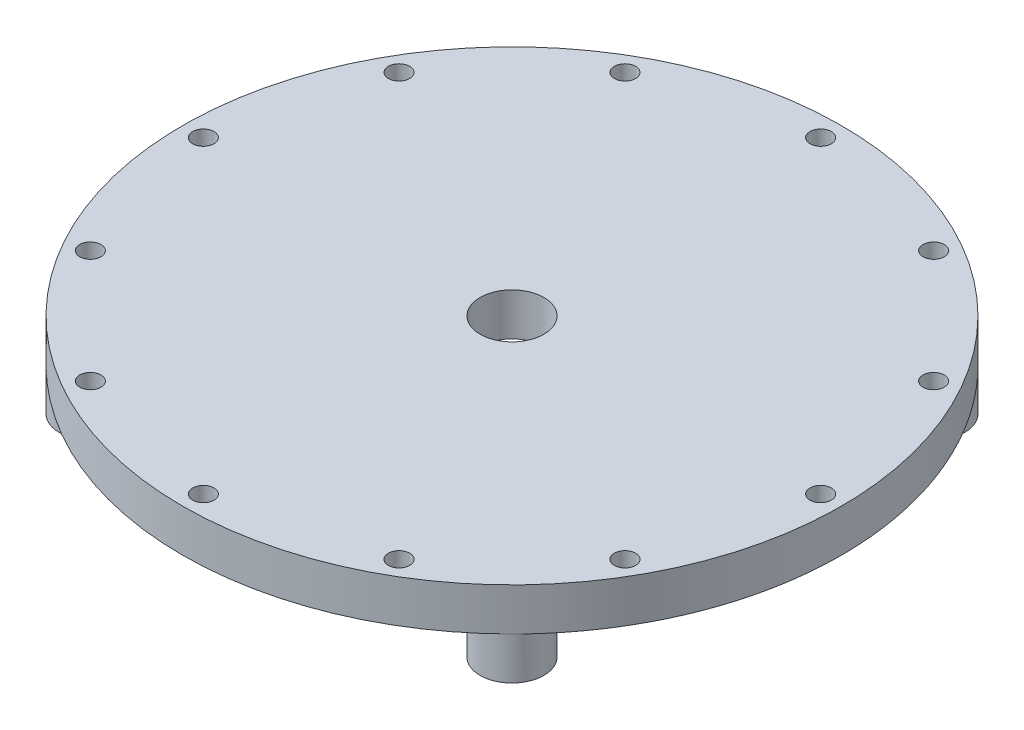
ISO-10303-21;
HEADER;
FILE_DESCRIPTION(('STEP AP214'),'2;1');
FILE_NAME('part.step','',(''),(''),'','','');
FILE_SCHEMA(('AUTOMOTIVE_DESIGN { 1 0 10303 214 1 1 1 1 }'));
ENDSEC;
DATA;
#1=APPLICATION_CONTEXT('core data for automotive mechanical design processes');
#2=APPLICATION_PROTOCOL_DEFINITION('international standard','automotive_design',2000,#1);
#3=PRODUCT_CONTEXT('',#1,'mechanical');
#4=PRODUCT('Part','Part','',(#3));
#5=PRODUCT_RELATED_PRODUCT_CATEGORY('part','',(#4));
#6=PRODUCT_DEFINITION_FORMATION('','',#4);
#7=PRODUCT_DEFINITION_CONTEXT('part definition',#1,'design');
#8=PRODUCT_DEFINITION('design','',#6,#7);
#9=PRODUCT_DEFINITION_SHAPE('','',#8);
#10=(LENGTH_UNIT() NAMED_UNIT(*) SI_UNIT(.MILLI.,.METRE.));
#11=(NAMED_UNIT(*) PLANE_ANGLE_UNIT() SI_UNIT($,.RADIAN.));
#12=(NAMED_UNIT(*) SI_UNIT($,.STERADIAN.) SOLID_ANGLE_UNIT());
#13=UNCERTAINTY_MEASURE_WITH_UNIT(LENGTH_MEASURE(1.E-05),#10,'distance_accuracy_value','');
#14=(GEOMETRIC_REPRESENTATION_CONTEXT(3) GLOBAL_UNCERTAINTY_ASSIGNED_CONTEXT((#13)) GLOBAL_UNIT_ASSIGNED_CONTEXT((#10,
#11,#12)) REPRESENTATION_CONTEXT('',''));
#15=CARTESIAN_POINT('',(0.,0.,0.));
#16=DIRECTION('',(0.,0.,1.));
#17=DIRECTION('',(1.,0.,0.));
#18=AXIS2_PLACEMENT_3D('',#15,#16,#17);
#19=CARTESIAN_POINT('',(0.,12.7,0.));
#20=DIRECTION('',(0.,-1.,0.));
#21=DIRECTION('',(0.,0.,-1.));
#22=AXIS2_PLACEMENT_3D('',#19,#20,#21);
#23=CYLINDRICAL_SURFACE('',#22,98.425);
#24=CARTESIAN_POINT('',(0.,12.7,0.));
#25=DIRECTION('',(0.,1.,0.));
#26=DIRECTION('',(0.,0.,1.));
#27=AXIS2_PLACEMENT_3D('',#24,#25,#26);
#28=CIRCLE('',#27,98.425);
#29=CARTESIAN_POINT('',(0.,12.7,98.425));
#30=VERTEX_POINT('',#29);
#31=EDGE_CURVE('E11',#30,#30,#28,.T.);
#32=ORIENTED_EDGE('',*,*,#31,.F.);
#33=EDGE_LOOP('',(#32));
#34=FACE_BOUND('',#33,.T.);
#35=CARTESIAN_POINT('',(0.,0.,0.));
#36=DIRECTION('',(0.,1.,0.));
#37=DIRECTION('',(0.,0.,1.));
#38=AXIS2_PLACEMENT_3D('',#35,#36,#37);
#39=CIRCLE('',#38,98.425);
#40=CARTESIAN_POINT('',(-69.5969849382863,0.,69.5969849382856));
#41=VERTEX_POINT('',#40);
#42=CARTESIAN_POINT('',(69.5969849382858,0.,69.5969849382861));
#43=VERTEX_POINT('',#42);
#44=EDGE_CURVE('E47',#41,#43,#39,.T.);
#45=ORIENTED_EDGE('',*,*,#44,.T.);
#46=CARTESIAN_POINT('',(69.5969849382863,0.,-69.5969849382856));
#47=VERTEX_POINT('',#46);
#48=EDGE_CURVE('E162',#43,#47,#39,.T.);
#49=ORIENTED_EDGE('',*,*,#48,.T.);
#50=CARTESIAN_POINT('',(-69.5969849382863,0.,-69.5969849382856));
#51=VERTEX_POINT('',#50);
#52=EDGE_CURVE('E73',#47,#51,#39,.T.);
#53=ORIENTED_EDGE('',*,*,#52,.T.);
#54=EDGE_CURVE('E68',#51,#41,#39,.T.);
#55=ORIENTED_EDGE('',*,*,#54,.T.);
#56=EDGE_LOOP('',(#45,#49,#53,#55));
#57=FACE_BOUND('',#56,.T.);
#58=ADVANCED_FACE('F39',(#34,#57),#23,.T.);
#59=CARTESIAN_POINT('',(0.,12.7,0.));
#60=DIRECTION('',(0.,1.,0.));
#61=DIRECTION('',(0.,0.,1.));
#62=AXIS2_PLACEMENT_3D('',#59,#60,#61);
#63=PLANE('',#62);
#64=CARTESIAN_POINT('',(-79.8492742797329,12.7,46.1009999999998));
#65=DIRECTION('',(0.,1.,0.));
#66=DIRECTION('',(-0.86602540378444,0.,0.499999999999998));
#67=AXIS2_PLACEMENT_3D('',#64,#65,#66);
#68=CIRCLE('',#67,3.175);
#69=CARTESIAN_POINT('',(-82.5989049367485,12.7,47.6884999999998));
#70=VERTEX_POINT('',#69);
#71=EDGE_CURVE('E104',#70,#70,#68,.T.);
#72=ORIENTED_EDGE('',*,*,#71,.F.);
#73=EDGE_LOOP('',(#72));
#74=FACE_BOUND('',#73,.T.);
#75=CARTESIAN_POINT('',(-92.202,12.7,-3.21921562404015E-13));
#76=DIRECTION('',(0.,1.,0.));
#77=DIRECTION('',(-1.,0.,0.));
#78=AXIS2_PLACEMENT_3D('',#75,#76,#77);
#79=CIRCLE('',#78,3.175);
#80=CARTESIAN_POINT('',(-95.377,12.7,-3.33007015654841E-13));
#81=VERTEX_POINT('',#80);
#82=EDGE_CURVE('E112',#81,#81,#79,.T.);
#83=ORIENTED_EDGE('',*,*,#82,.F.);
#84=EDGE_LOOP('',(#83));
#85=FACE_BOUND('',#84,.T.);
#86=CARTESIAN_POINT('',(-79.8492742797326,12.7,-46.1010000000004));
#87=DIRECTION('',(0.,1.,0.));
#88=DIRECTION('',(-0.866025403784436,0.,-0.500000000000004));
#89=AXIS2_PLACEMENT_3D('',#86,#87,#88);
#90=CIRCLE('',#89,3.175);
#91=CARTESIAN_POINT('',(-82.5989049367482,12.7,-47.6885000000004));
#92=VERTEX_POINT('',#91);
#93=EDGE_CURVE('E118',#92,#92,#90,.T.);
#94=ORIENTED_EDGE('',*,*,#93,.F.);
#95=EDGE_LOOP('',(#94));
#96=FACE_BOUND('',#95,.T.);
#97=CARTESIAN_POINT('',(-46.1009999999995,12.7,-79.8492742797331));
#98=DIRECTION('',(0.,1.,0.));
#99=DIRECTION('',(-0.499999999999995,0.,-0.866025403784442));
#100=AXIS2_PLACEMENT_3D('',#97,#98,#99);
#101=CIRCLE('',#100,3.175);
#102=CARTESIAN_POINT('',(-47.6884999999995,12.7,-82.5989049367487));
#103=VERTEX_POINT('',#102);
#104=EDGE_CURVE('E124',#103,#103,#101,.T.);
#105=ORIENTED_EDGE('',*,*,#104,.F.);
#106=EDGE_LOOP('',(#105));
#107=FACE_BOUND('',#106,.T.);
#108=CARTESIAN_POINT('',(0.,12.7,-92.202));
#109=DIRECTION('',(0.,1.,0.));
#110=DIRECTION('',(0.,0.,-1.));
#111=AXIS2_PLACEMENT_3D('',#108,#109,#110);
#112=CIRCLE('',#111,3.175);
#113=CARTESIAN_POINT('',(0.,12.7,-95.377));
#114=VERTEX_POINT('',#113);
#115=EDGE_CURVE('E130',#114,#114,#112,.T.);
#116=ORIENTED_EDGE('',*,*,#115,.F.);
#117=EDGE_LOOP('',(#116));
#118=FACE_BOUND('',#117,.T.);
#119=CARTESIAN_POINT('',(46.1010000000006,12.7,-79.8492742797324));
#120=DIRECTION('',(0.,1.,0.));
#121=DIRECTION('',(0.500000000000007,0.,-0.866025403784435));
#122=AXIS2_PLACEMENT_3D('',#119,#120,#121);
#123=CIRCLE('',#122,3.175);
#124=CARTESIAN_POINT('',(47.6885000000007,12.7,-82.598904936748));
#125=VERTEX_POINT('',#124);
#126=EDGE_CURVE('E136',#125,#125,#123,.T.);
#127=ORIENTED_EDGE('',*,*,#126,.F.);
#128=EDGE_LOOP('',(#127));
#129=FACE_BOUND('',#128,.T.);
#130=CARTESIAN_POINT('',(79.8492742797332,12.7,-46.1009999999993));
#131=DIRECTION('',(0.,1.,0.));
#132=DIRECTION('',(0.866025403784443,0.,-0.499999999999992));
#133=AXIS2_PLACEMENT_3D('',#130,#131,#132);
#134=CIRCLE('',#133,3.175);
#135=CARTESIAN_POINT('',(82.5989049367489,12.7,-47.6884999999992));
#136=VERTEX_POINT('',#135);
#137=EDGE_CURVE('E142',#136,#136,#134,.T.);
#138=ORIENTED_EDGE('',*,*,#137,.F.);
#139=EDGE_LOOP('',(#138));
#140=FACE_BOUND('',#139,.T.);
#141=CARTESIAN_POINT('',(92.202,12.7,9.65764687212044E-13));
#142=DIRECTION('',(0.,1.,0.));
#143=DIRECTION('',(1.,0.,0.));
#144=AXIS2_PLACEMENT_3D('',#141,#142,#143);
#145=CIRCLE('',#144,3.175);
#146=CARTESIAN_POINT('',(95.377,12.7,9.99021046964524E-13));
#147=VERTEX_POINT('',#146);
#148=EDGE_CURVE('E99',#147,#147,#145,.T.);
#149=ORIENTED_EDGE('',*,*,#148,.F.);
#150=EDGE_LOOP('',(#149));
#151=FACE_BOUND('',#150,.T.);
#152=CARTESIAN_POINT('',(79.8492742797323,12.7,46.1010000000009));
#153=DIRECTION('',(0.,1.,0.));
#154=DIRECTION('',(0.866025403784433,0.,0.50000000000001));
#155=AXIS2_PLACEMENT_3D('',#152,#153,#154);
#156=CIRCLE('',#155,3.175);
#157=CARTESIAN_POINT('',(82.5989049367478,12.7,47.688500000001));
#158=VERTEX_POINT('',#157);
#159=EDGE_CURVE('E92',#158,#158,#156,.T.);
#160=ORIENTED_EDGE('',*,*,#159,.F.);
#161=EDGE_LOOP('',(#160));
#162=FACE_BOUND('',#161,.T.);
#163=CARTESIAN_POINT('',(46.100999999999,12.7,79.8492742797334));
#164=DIRECTION('',(0.,1.,0.));
#165=DIRECTION('',(0.499999999999989,0.,0.866025403784445));
#166=AXIS2_PLACEMENT_3D('',#163,#164,#165);
#167=CIRCLE('',#166,3.175);
#168=CARTESIAN_POINT('',(47.6884999999989,12.7,82.598904936749));
#169=VERTEX_POINT('',#168);
#170=EDGE_CURVE('E85',#169,#169,#167,.T.);
#171=ORIENTED_EDGE('',*,*,#170,.F.);
#172=EDGE_LOOP('',(#171));
#173=FACE_BOUND('',#172,.T.);
#174=CARTESIAN_POINT('',(-46.1010000000001,12.7,79.8492742797328));
#175=DIRECTION('',(0.,1.,0.));
#176=DIRECTION('',(-0.500000000000001,0.,0.866025403784438));
#177=AXIS2_PLACEMENT_3D('',#174,#175,#176);
#178=CIRCLE('',#177,3.175);
#179=CARTESIAN_POINT('',(-47.6885000000001,12.7,82.5989049367483));
#180=VERTEX_POINT('',#179);
#181=EDGE_CURVE('E111',#180,#180,#178,.T.);
#182=ORIENTED_EDGE('',*,*,#181,.F.);
#183=EDGE_LOOP('',(#182));
#184=FACE_BOUND('',#183,.T.);
#185=CARTESIAN_POINT('',(0.,12.7,92.202));
#186=DIRECTION('',(0.,1.,0.));
#187=DIRECTION('',(0.,0.,1.));
#188=AXIS2_PLACEMENT_3D('',#185,#186,#187);
#189=CIRCLE('',#188,3.175);
#190=CARTESIAN_POINT('',(0.,12.7,95.377));
#191=VERTEX_POINT('',#190);
#192=EDGE_CURVE('E157',#191,#191,#189,.T.);
#193=ORIENTED_EDGE('',*,*,#192,.F.);
#194=EDGE_LOOP('',(#193));
#195=FACE_BOUND('',#194,.T.);
#196=CARTESIAN_POINT('',(0.,12.7,0.));
#197=DIRECTION('',(0.,1.,0.));
#198=DIRECTION('',(0.,0.,1.));
#199=AXIS2_PLACEMENT_3D('',#196,#197,#198);
#200=CIRCLE('',#199,9.525);
#201=CARTESIAN_POINT('',(0.,12.7,9.525));
#202=VERTEX_POINT('',#201);
#203=EDGE_CURVE('E160',#202,#202,#200,.T.);
#204=ORIENTED_EDGE('',*,*,#203,.F.);
#205=EDGE_LOOP('',(#204));
#206=FACE_BOUND('',#205,.T.);
#207=ORIENTED_EDGE('',*,*,#31,.T.);
#208=EDGE_LOOP('',(#207));
#209=FACE_BOUND('',#208,.T.);
#210=ADVANCED_FACE('F170',(#74,#85,#96,#107,#118,#129,#140,#151,#162,#173,#184,#195,#206,#209),
#63,.T.);
#211=CARTESIAN_POINT('',(0.,0.,0.));
#212=DIRECTION('',(0.,1.,0.));
#213=DIRECTION('',(0.,0.,1.));
#214=AXIS2_PLACEMENT_3D('',#211,#212,#213);
#215=PLANE('',#214);
#216=CARTESIAN_POINT('',(-79.8492742797329,0.,46.1009999999998));
#217=DIRECTION('',(0.,1.,0.));
#218=DIRECTION('',(-0.86602540378444,0.,0.499999999999998));
#219=AXIS2_PLACEMENT_3D('',#216,#217,#218);
#220=CIRCLE('',#219,3.175);
#221=CARTESIAN_POINT('',(-82.5989049367485,0.,47.6884999999998));
#222=VERTEX_POINT('',#221);
#223=EDGE_CURVE('E107',#222,#222,#220,.F.);
#224=ORIENTED_EDGE('',*,*,#223,.F.);
#225=EDGE_LOOP('',(#224));
#226=FACE_BOUND('',#225,.T.);
#227=CARTESIAN_POINT('',(-92.202,0.,-3.21921562404015E-13));
#228=DIRECTION('',(0.,1.,0.));
#229=DIRECTION('',(-1.,0.,0.));
#230=AXIS2_PLACEMENT_3D('',#227,#228,#229);
#231=CIRCLE('',#230,3.175);
#232=CARTESIAN_POINT('',(-95.377,0.,-3.33007015654841E-13));
#233=VERTEX_POINT('',#232);
#234=EDGE_CURVE('E108',#233,#233,#231,.F.);
#235=ORIENTED_EDGE('',*,*,#234,.F.);
#236=EDGE_LOOP('',(#235));
#237=FACE_BOUND('',#236,.T.);
#238=CARTESIAN_POINT('',(-79.8492742797326,0.,-46.1010000000004));
#239=DIRECTION('',(0.,1.,0.));
#240=DIRECTION('',(-0.866025403784436,0.,-0.500000000000004));
#241=AXIS2_PLACEMENT_3D('',#238,#239,#240);
#242=CIRCLE('',#241,3.175);
#243=CARTESIAN_POINT('',(-82.5989049367482,0.,-47.6885000000004));
#244=VERTEX_POINT('',#243);
#245=EDGE_CURVE('E115',#244,#244,#242,.F.);
#246=ORIENTED_EDGE('',*,*,#245,.F.);
#247=EDGE_LOOP('',(#246));
#248=FACE_BOUND('',#247,.T.);
#249=CARTESIAN_POINT('',(-46.1009999999995,0.,-79.8492742797331));
#250=DIRECTION('',(0.,1.,0.));
#251=DIRECTION('',(-0.499999999999995,0.,-0.866025403784442));
#252=AXIS2_PLACEMENT_3D('',#249,#250,#251);
#253=CIRCLE('',#252,3.175);
#254=CARTESIAN_POINT('',(-47.6884999999995,0.,-82.5989049367487));
#255=VERTEX_POINT('',#254);
#256=EDGE_CURVE('E121',#255,#255,#253,.F.);
#257=ORIENTED_EDGE('',*,*,#256,.F.);
#258=EDGE_LOOP('',(#257));
#259=FACE_BOUND('',#258,.T.);
#260=CARTESIAN_POINT('',(0.,0.,-92.202));
#261=DIRECTION('',(0.,1.,0.));
#262=DIRECTION('',(0.,0.,-1.));
#263=AXIS2_PLACEMENT_3D('',#260,#261,#262);
#264=CIRCLE('',#263,3.175);
#265=CARTESIAN_POINT('',(0.,0.,-95.377));
#266=VERTEX_POINT('',#265);
#267=EDGE_CURVE('E127',#266,#266,#264,.F.);
#268=ORIENTED_EDGE('',*,*,#267,.F.);
#269=EDGE_LOOP('',(#268));
#270=FACE_BOUND('',#269,.T.);
#271=CARTESIAN_POINT('',(46.1010000000006,0.,-79.8492742797324));
#272=DIRECTION('',(0.,1.,0.));
#273=DIRECTION('',(0.500000000000007,0.,-0.866025403784435));
#274=AXIS2_PLACEMENT_3D('',#271,#272,#273);
#275=CIRCLE('',#274,3.175);
#276=CARTESIAN_POINT('',(47.6885000000007,0.,-82.598904936748));
#277=VERTEX_POINT('',#276);
#278=EDGE_CURVE('E133',#277,#277,#275,.F.);
#279=ORIENTED_EDGE('',*,*,#278,.F.);
#280=EDGE_LOOP('',(#279));
#281=FACE_BOUND('',#280,.T.);
#282=CARTESIAN_POINT('',(79.8492742797332,0.,-46.1009999999993));
#283=DIRECTION('',(0.,1.,0.));
#284=DIRECTION('',(0.866025403784443,0.,-0.499999999999992));
#285=AXIS2_PLACEMENT_3D('',#282,#283,#284);
#286=CIRCLE('',#285,3.175);
#287=CARTESIAN_POINT('',(82.5989049367489,0.,-47.6884999999992));
#288=VERTEX_POINT('',#287);
#289=EDGE_CURVE('E139',#288,#288,#286,.F.);
#290=ORIENTED_EDGE('',*,*,#289,.F.);
#291=EDGE_LOOP('',(#290));
#292=FACE_BOUND('',#291,.T.);
#293=CARTESIAN_POINT('',(92.202,0.,9.65764687212044E-13));
#294=DIRECTION('',(0.,1.,0.));
#295=DIRECTION('',(1.,0.,0.));
#296=AXIS2_PLACEMENT_3D('',#293,#294,#295);
#297=CIRCLE('',#296,3.175);
#298=CARTESIAN_POINT('',(95.377,0.,9.99021046964524E-13));
#299=VERTEX_POINT('',#298);
#300=EDGE_CURVE('E145',#299,#299,#297,.F.);
#301=ORIENTED_EDGE('',*,*,#300,.F.);
#302=EDGE_LOOP('',(#301));
#303=FACE_BOUND('',#302,.T.);
#304=CARTESIAN_POINT('',(79.8492742797323,0.,46.1010000000009));
#305=DIRECTION('',(0.,1.,0.));
#306=DIRECTION('',(0.866025403784433,0.,0.50000000000001));
#307=AXIS2_PLACEMENT_3D('',#304,#305,#306);
#308=CIRCLE('',#307,3.175);
#309=CARTESIAN_POINT('',(82.5989049367478,0.,47.688500000001));
#310=VERTEX_POINT('',#309);
#311=EDGE_CURVE('E95',#310,#310,#308,.F.);
#312=ORIENTED_EDGE('',*,*,#311,.F.);
#313=EDGE_LOOP('',(#312));
#314=FACE_BOUND('',#313,.T.);
#315=CARTESIAN_POINT('',(46.100999999999,0.,79.8492742797334));
#316=DIRECTION('',(0.,1.,0.));
#317=DIRECTION('',(0.499999999999989,0.,0.866025403784445));
#318=AXIS2_PLACEMENT_3D('',#315,#316,#317);
#319=CIRCLE('',#318,3.175);
#320=CARTESIAN_POINT('',(47.6884999999989,0.,82.598904936749));
#321=VERTEX_POINT('',#320);
#322=EDGE_CURVE('E96',#321,#321,#319,.F.);
#323=ORIENTED_EDGE('',*,*,#322,.F.);
#324=EDGE_LOOP('',(#323));
#325=FACE_BOUND('',#324,.T.);
#326=CARTESIAN_POINT('',(-46.1010000000001,0.,79.8492742797328));
#327=DIRECTION('',(0.,1.,0.));
#328=DIRECTION('',(-0.500000000000001,0.,0.866025403784438));
#329=AXIS2_PLACEMENT_3D('',#326,#327,#328);
#330=CIRCLE('',#329,3.175);
#331=CARTESIAN_POINT('',(-47.6885000000001,0.,82.5989049367483));
#332=VERTEX_POINT('',#331);
#333=EDGE_CURVE('E154',#332,#332,#330,.F.);
#334=ORIENTED_EDGE('',*,*,#333,.F.);
#335=EDGE_LOOP('',(#334));
#336=FACE_BOUND('',#335,.T.);
#337=CARTESIAN_POINT('',(0.,0.,92.202));
#338=DIRECTION('',(0.,1.,0.));
#339=DIRECTION('',(0.,0.,1.));
#340=AXIS2_PLACEMENT_3D('',#337,#338,#339);
#341=CIRCLE('',#340,3.175);
#342=CARTESIAN_POINT('',(0.,0.,95.377));
#343=VERTEX_POINT('',#342);
#344=EDGE_CURVE('E42',#343,#343,#341,.F.);
#345=ORIENTED_EDGE('',*,*,#344,.F.);
#346=EDGE_LOOP('',(#345));
#347=FACE_BOUND('',#346,.T.);
#348=CARTESIAN_POINT('',(0.,0.,0.));
#349=DIRECTION('',(0.,1.,0.));
#350=DIRECTION('',(0.,0.,1.));
#351=AXIS2_PLACEMENT_3D('',#348,#349,#350);
#352=CIRCLE('',#351,9.525);
#353=CARTESIAN_POINT('',(0.,0.,9.525));
#354=VERTEX_POINT('',#353);
#355=EDGE_CURVE('E76',#354,#354,#352,.F.);
#356=ORIENTED_EDGE('',*,*,#355,.F.);
#357=EDGE_LOOP('',(#356));
#358=FACE_BOUND('',#357,.T.);
#359=ORIENTED_EDGE('',*,*,#54,.F.);
#360=CARTESIAN_POINT('',(-62.8617928474844,0.,-62.8617928474837));
#361=DIRECTION('',(0.,1.,0.));
#362=DIRECTION('',(-1.,0.,0.));
#363=AXIS2_PLACEMENT_3D('',#360,#361,#362);
#364=CIRCLE('',#363,9.52500000000002);
#365=EDGE_CURVE('E53',#51,#51,#364,.T.);
#366=ORIENTED_EDGE('',*,*,#365,.T.);
#367=ORIENTED_EDGE('',*,*,#52,.F.);
#368=CARTESIAN_POINT('',(62.8617928474844,0.,-62.8617928474837));
#369=DIRECTION('',(0.,1.,0.));
#370=DIRECTION('',(0.,0.,-1.));
#371=AXIS2_PLACEMENT_3D('',#368,#369,#370);
#372=CIRCLE('',#371,9.52500000000002);
#373=EDGE_CURVE('E58',#47,#47,#372,.T.);
#374=ORIENTED_EDGE('',*,*,#373,.T.);
#375=ORIENTED_EDGE('',*,*,#48,.F.);
#376=CARTESIAN_POINT('',(62.861792847484,0.,62.8617928474842));
#377=DIRECTION('',(0.,1.,0.));
#378=DIRECTION('',(1.,0.,0.));
#379=AXIS2_PLACEMENT_3D('',#376,#377,#378);
#380=CIRCLE('',#379,9.52500000000002);
#381=EDGE_CURVE('E520',#43,#43,#380,.T.);
#382=ORIENTED_EDGE('',*,*,#381,.T.);
#383=ORIENTED_EDGE('',*,*,#44,.F.);
#384=CARTESIAN_POINT('',(-62.8617928474844,0.,62.8617928474837));
#385=DIRECTION('',(0.,1.,0.));
#386=DIRECTION('',(0.,0.,1.));
#387=AXIS2_PLACEMENT_3D('',#384,#385,#386);
#388=CIRCLE('',#387,9.52500000000002);
#389=EDGE_CURVE('E79',#41,#41,#388,.T.);
#390=ORIENTED_EDGE('',*,*,#389,.T.);
#391=EDGE_LOOP('',(#359,#366,#367,#374,#375,#382,#383,#390));
#392=FACE_BOUND('',#391,.T.);
#393=ADVANCED_FACE('F168',(#226,#237,#248,#259,#270,#281,#292,#303,#314,#325,#336,#347,#358,
#392),#215,.F.);
#394=CARTESIAN_POINT('',(0.,12.7,0.));
#395=DIRECTION('',(0.,-1.,0.));
#396=DIRECTION('',(0.,0.,-1.));
#397=AXIS2_PLACEMENT_3D('',#394,#395,#396);
#398=CYLINDRICAL_SURFACE('',#397,9.525);
#399=ORIENTED_EDGE('',*,*,#203,.T.);
#400=EDGE_LOOP('',(#399));
#401=FACE_BOUND('',#400,.T.);
#402=ORIENTED_EDGE('',*,*,#355,.T.);
#403=EDGE_LOOP('',(#402));
#404=FACE_BOUND('',#403,.T.);
#405=ADVANCED_FACE('F166',(#401,#404),#398,.F.);
#406=CARTESIAN_POINT('',(0.,12.701,92.202));
#407=DIRECTION('',(0.,-1.,0.));
#408=DIRECTION('',(0.,0.,-1.));
#409=AXIS2_PLACEMENT_3D('',#406,#407,#408);
#410=CYLINDRICAL_SURFACE('',#409,3.175);
#411=ORIENTED_EDGE('',*,*,#192,.T.);
#412=EDGE_LOOP('',(#411));
#413=FACE_BOUND('',#412,.T.);
#414=ORIENTED_EDGE('',*,*,#344,.T.);
#415=EDGE_LOOP('',(#414));
#416=FACE_BOUND('',#415,.T.);
#417=ADVANCED_FACE('F176',(#413,#416),#410,.F.);
#418=CARTESIAN_POINT('',(-46.1010000000001,12.701,79.8492742797328));
#419=DIRECTION('',(0.,-1.,0.));
#420=DIRECTION('',(0.500000000000001,0.,-0.866025403784438));
#421=AXIS2_PLACEMENT_3D('',#418,#419,#420);
#422=CYLINDRICAL_SURFACE('',#421,3.175);
#423=ORIENTED_EDGE('',*,*,#181,.T.);
#424=EDGE_LOOP('',(#423));
#425=FACE_BOUND('',#424,.T.);
#426=ORIENTED_EDGE('',*,*,#333,.T.);
#427=EDGE_LOOP('',(#426));
#428=FACE_BOUND('',#427,.T.);
#429=ADVANCED_FACE('F205',(#425,#428),#422,.F.);
#430=CARTESIAN_POINT('',(46.100999999999,12.701,79.8492742797334));
#431=DIRECTION('',(0.,-1.,0.));
#432=DIRECTION('',(-0.499999999999989,0.,-0.866025403784445));
#433=AXIS2_PLACEMENT_3D('',#430,#431,#432);
#434=CYLINDRICAL_SURFACE('',#433,3.175);
#435=ORIENTED_EDGE('',*,*,#170,.T.);
#436=EDGE_LOOP('',(#435));
#437=FACE_BOUND('',#436,.T.);
#438=ORIENTED_EDGE('',*,*,#322,.T.);
#439=EDGE_LOOP('',(#438));
#440=FACE_BOUND('',#439,.T.);
#441=ADVANCED_FACE('F210',(#437,#440),#434,.F.);
#442=CARTESIAN_POINT('',(79.8492742797323,12.701,46.1010000000009));
#443=DIRECTION('',(0.,-1.,0.));
#444=DIRECTION('',(-0.866025403784433,0.,-0.50000000000001));
#445=AXIS2_PLACEMENT_3D('',#442,#443,#444);
#446=CYLINDRICAL_SURFACE('',#445,3.175);
#447=ORIENTED_EDGE('',*,*,#159,.T.);
#448=EDGE_LOOP('',(#447));
#449=FACE_BOUND('',#448,.T.);
#450=ORIENTED_EDGE('',*,*,#311,.T.);
#451=EDGE_LOOP('',(#450));
#452=FACE_BOUND('',#451,.T.);
#453=ADVANCED_FACE('F220',(#449,#452),#446,.F.);
#454=CARTESIAN_POINT('',(92.202,12.701,9.65764687212044E-13));
#455=DIRECTION('',(0.,-1.,0.));
#456=DIRECTION('',(-1.,0.,0.));
#457=AXIS2_PLACEMENT_3D('',#454,#455,#456);
#458=CYLINDRICAL_SURFACE('',#457,3.175);
#459=ORIENTED_EDGE('',*,*,#148,.T.);
#460=EDGE_LOOP('',(#459));
#461=FACE_BOUND('',#460,.T.);
#462=ORIENTED_EDGE('',*,*,#300,.T.);
#463=EDGE_LOOP('',(#462));
#464=FACE_BOUND('',#463,.T.);
#465=ADVANCED_FACE('F230',(#461,#464),#458,.F.);
#466=CARTESIAN_POINT('',(79.8492742797332,12.701,-46.1009999999993));
#467=DIRECTION('',(0.,-1.,0.));
#468=DIRECTION('',(-0.866025403784443,0.,0.499999999999992));
#469=AXIS2_PLACEMENT_3D('',#466,#467,#468);
#470=CYLINDRICAL_SURFACE('',#469,3.175);
#471=ORIENTED_EDGE('',*,*,#137,.T.);
#472=EDGE_LOOP('',(#471));
#473=FACE_BOUND('',#472,.T.);
#474=ORIENTED_EDGE('',*,*,#289,.T.);
#475=EDGE_LOOP('',(#474));
#476=FACE_BOUND('',#475,.T.);
#477=ADVANCED_FACE('F240',(#473,#476),#470,.F.);
#478=CARTESIAN_POINT('',(46.1010000000006,12.701,-79.8492742797324));
#479=DIRECTION('',(0.,-1.,0.));
#480=DIRECTION('',(-0.500000000000007,0.,0.866025403784435));
#481=AXIS2_PLACEMENT_3D('',#478,#479,#480);
#482=CYLINDRICAL_SURFACE('',#481,3.175);
#483=ORIENTED_EDGE('',*,*,#126,.T.);
#484=EDGE_LOOP('',(#483));
#485=FACE_BOUND('',#484,.T.);
#486=ORIENTED_EDGE('',*,*,#278,.T.);
#487=EDGE_LOOP('',(#486));
#488=FACE_BOUND('',#487,.T.);
#489=ADVANCED_FACE('F250',(#485,#488),#482,.F.);
#490=CARTESIAN_POINT('',(0.,12.701,-92.202));
#491=DIRECTION('',(0.,-1.,0.));
#492=DIRECTION('',(0.,0.,1.));
#493=AXIS2_PLACEMENT_3D('',#490,#491,#492);
#494=CYLINDRICAL_SURFACE('',#493,3.175);
#495=ORIENTED_EDGE('',*,*,#115,.T.);
#496=EDGE_LOOP('',(#495));
#497=FACE_BOUND('',#496,.T.);
#498=ORIENTED_EDGE('',*,*,#267,.T.);
#499=EDGE_LOOP('',(#498));
#500=FACE_BOUND('',#499,.T.);
#501=ADVANCED_FACE('F260',(#497,#500),#494,.F.);
#502=CARTESIAN_POINT('',(-46.1009999999995,12.701,-79.8492742797331));
#503=DIRECTION('',(0.,-1.,0.));
#504=DIRECTION('',(0.499999999999995,0.,0.866025403784442));
#505=AXIS2_PLACEMENT_3D('',#502,#503,#504);
#506=CYLINDRICAL_SURFACE('',#505,3.175);
#507=ORIENTED_EDGE('',*,*,#104,.T.);
#508=EDGE_LOOP('',(#507));
#509=FACE_BOUND('',#508,.T.);
#510=ORIENTED_EDGE('',*,*,#256,.T.);
#511=EDGE_LOOP('',(#510));
#512=FACE_BOUND('',#511,.T.);
#513=ADVANCED_FACE('F270',(#509,#512),#506,.F.);
#514=CARTESIAN_POINT('',(-79.8492742797326,12.701,-46.1010000000004));
#515=DIRECTION('',(0.,-1.,0.));
#516=DIRECTION('',(0.866025403784436,0.,0.500000000000004));
#517=AXIS2_PLACEMENT_3D('',#514,#515,#516);
#518=CYLINDRICAL_SURFACE('',#517,3.175);
#519=ORIENTED_EDGE('',*,*,#93,.T.);
#520=EDGE_LOOP('',(#519));
#521=FACE_BOUND('',#520,.T.);
#522=ORIENTED_EDGE('',*,*,#245,.T.);
#523=EDGE_LOOP('',(#522));
#524=FACE_BOUND('',#523,.T.);
#525=ADVANCED_FACE('F280',(#521,#524),#518,.F.);
#526=CARTESIAN_POINT('',(-92.202,12.701,-3.21921562404015E-13));
#527=DIRECTION('',(0.,-1.,0.));
#528=DIRECTION('',(1.,0.,0.));
#529=AXIS2_PLACEMENT_3D('',#526,#527,#528);
#530=CYLINDRICAL_SURFACE('',#529,3.175);
#531=ORIENTED_EDGE('',*,*,#82,.T.);
#532=EDGE_LOOP('',(#531));
#533=FACE_BOUND('',#532,.T.);
#534=ORIENTED_EDGE('',*,*,#234,.T.);
#535=EDGE_LOOP('',(#534));
#536=FACE_BOUND('',#535,.T.);
#537=ADVANCED_FACE('F290',(#533,#536),#530,.F.);
#538=CARTESIAN_POINT('',(-79.8492742797329,12.701,46.1009999999998));
#539=DIRECTION('',(0.,-1.,0.));
#540=DIRECTION('',(0.86602540378444,0.,-0.499999999999998));
#541=AXIS2_PLACEMENT_3D('',#538,#539,#540);
#542=CYLINDRICAL_SURFACE('',#541,3.175);
#543=ORIENTED_EDGE('',*,*,#71,.T.);
#544=EDGE_LOOP('',(#543));
#545=FACE_BOUND('',#544,.T.);
#546=ORIENTED_EDGE('',*,*,#223,.T.);
#547=EDGE_LOOP('',(#546));
#548=FACE_BOUND('',#547,.T.);
#549=ADVANCED_FACE('F300',(#545,#548),#542,.F.);
#550=CARTESIAN_POINT('',(-62.8617928474844,-12.7,62.8617928474837));
#551=DIRECTION('',(0.,1.,0.));
#552=DIRECTION('',(0.,0.,1.));
#553=AXIS2_PLACEMENT_3D('',#550,#551,#552);
#554=CYLINDRICAL_SURFACE('',#553,9.52500000000002);
#555=CARTESIAN_POINT('',(-62.8617928474844,-12.7,62.8617928474837));
#556=DIRECTION('',(0.,1.,0.));
#557=DIRECTION('',(0.,0.,1.));
#558=AXIS2_PLACEMENT_3D('',#555,#556,#557);
#559=CIRCLE('',#558,9.52500000000002);
#560=CARTESIAN_POINT('',(-62.8617928474844,-12.7,72.3867928474838));
#561=VERTEX_POINT('',#560);
#562=EDGE_CURVE('E81',#561,#561,#559,.T.);
#563=ORIENTED_EDGE('',*,*,#562,.T.);
#564=EDGE_LOOP('',(#563));
#565=FACE_BOUND('',#564,.T.);
#566=ORIENTED_EDGE('',*,*,#389,.F.);
#567=EDGE_LOOP('',(#566));
#568=FACE_BOUND('',#567,.T.);
#569=ADVANCED_FACE('F80',(#565,#568),#554,.T.);
#570=CARTESIAN_POINT('',(-62.8617928474844,-12.7,62.8617928474837));
#571=DIRECTION('',(0.,1.,0.));
#572=DIRECTION('',(0.,0.,1.));
#573=AXIS2_PLACEMENT_3D('',#570,#571,#572);
#574=PLANE('',#573);
#575=CARTESIAN_POINT('',(-62.8617928474844,-12.7,62.8617928474837));
#576=DIRECTION('',(0.,1.,0.));
#577=DIRECTION('',(0.,0.,1.));
#578=AXIS2_PLACEMENT_3D('',#575,#576,#577);
#579=CIRCLE('',#578,3.175);
#580=CARTESIAN_POINT('',(-62.8617928474844,-12.7,66.0367928474837));
#581=VERTEX_POINT('',#580);
#582=EDGE_CURVE('E88',#581,#581,#579,.T.);
#583=ORIENTED_EDGE('',*,*,#582,.T.);
#584=EDGE_LOOP('',(#583));
#585=FACE_BOUND('',#584,.T.);
#586=ORIENTED_EDGE('',*,*,#562,.F.);
#587=EDGE_LOOP('',(#586));
#588=FACE_BOUND('',#587,.T.);
#589=ADVANCED_FACE('F319',(#585,#588),#574,.F.);
#590=CARTESIAN_POINT('',(-62.8617928474844,2.54,62.8617928474837));
#591=DIRECTION('',(0.,-1.,0.));
#592=DIRECTION('',(0.,0.,-1.));
#593=AXIS2_PLACEMENT_3D('',#590,#591,#592);
#594=CYLINDRICAL_SURFACE('',#593,3.175);
#595=CARTESIAN_POINT('',(-62.8617928474844,2.54,62.8617928474837));
#596=DIRECTION('',(0.,1.,0.));
#597=DIRECTION('',(0.,0.,1.));
#598=AXIS2_PLACEMENT_3D('',#595,#596,#597);
#599=CIRCLE('',#598,3.175);
#600=CARTESIAN_POINT('',(-62.8617928474844,2.54,66.0367928474837));
#601=VERTEX_POINT('',#600);
#602=EDGE_CURVE('E82',#601,#601,#599,.T.);
#603=ORIENTED_EDGE('',*,*,#602,.T.);
#604=EDGE_LOOP('',(#603));
#605=FACE_BOUND('',#604,.T.);
#606=ORIENTED_EDGE('',*,*,#582,.F.);
#607=EDGE_LOOP('',(#606));
#608=FACE_BOUND('',#607,.T.);
#609=ADVANCED_FACE('F329',(#605,#608),#594,.F.);
#610=CARTESIAN_POINT('',(-62.8617928474844,2.54,62.8617928474837));
#611=DIRECTION('',(0.,1.,0.));
#612=DIRECTION('',(0.,0.,1.));
#613=AXIS2_PLACEMENT_3D('',#610,#611,#612);
#614=PLANE('',#613);
#615=ORIENTED_EDGE('',*,*,#602,.F.);
#616=EDGE_LOOP('',(#615));
#617=FACE_BOUND('',#616,.T.);
#618=ADVANCED_FACE('F338',(#617),#614,.F.);
#619=CARTESIAN_POINT('',(62.861792847484,-12.7,62.8617928474842));
#620=DIRECTION('',(0.,1.,0.));
#621=DIRECTION('',(0.,0.,1.));
#622=AXIS2_PLACEMENT_3D('',#619,#620,#621);
#623=CYLINDRICAL_SURFACE('',#622,9.52500000000002);
#624=CARTESIAN_POINT('',(62.861792847484,-12.7,62.8617928474842));
#625=DIRECTION('',(0.,1.,0.));
#626=DIRECTION('',(1.,0.,0.));
#627=AXIS2_PLACEMENT_3D('',#624,#625,#626);
#628=CIRCLE('',#627,9.52500000000002);
#629=CARTESIAN_POINT('',(72.386792847484,-12.7,62.8617928474841));
#630=VERTEX_POINT('',#629);
#631=EDGE_CURVE('E522',#630,#630,#628,.T.);
#632=ORIENTED_EDGE('',*,*,#631,.T.);
#633=EDGE_LOOP('',(#632));
#634=FACE_BOUND('',#633,.T.);
#635=ORIENTED_EDGE('',*,*,#381,.F.);
#636=EDGE_LOOP('',(#635));
#637=FACE_BOUND('',#636,.T.);
#638=ADVANCED_FACE('F347',(#634,#637),#623,.T.);
#639=CARTESIAN_POINT('',(62.861792847484,-12.7,62.8617928474842));
#640=DIRECTION('',(0.,1.,0.));
#641=DIRECTION('',(1.,0.,0.));
#642=AXIS2_PLACEMENT_3D('',#639,#640,#641);
#643=PLANE('',#642);
#644=CARTESIAN_POINT('',(62.861792847484,-12.7,62.8617928474842));
#645=DIRECTION('',(0.,1.,0.));
#646=DIRECTION('',(0.,0.,1.));
#647=AXIS2_PLACEMENT_3D('',#644,#645,#646);
#648=CIRCLE('',#647,3.175);
#649=CARTESIAN_POINT('',(62.861792847484,-12.7,66.0367928474842));
#650=VERTEX_POINT('',#649);
#651=EDGE_CURVE('E496',#650,#650,#648,.T.);
#652=ORIENTED_EDGE('',*,*,#651,.T.);
#653=EDGE_LOOP('',(#652));
#654=FACE_BOUND('',#653,.T.);
#655=ORIENTED_EDGE('',*,*,#631,.F.);
#656=EDGE_LOOP('',(#655));
#657=FACE_BOUND('',#656,.T.);
#658=ADVANCED_FACE('F358',(#654,#657),#643,.F.);
#659=CARTESIAN_POINT('',(62.8617928474844,-12.7,-62.8617928474837));
#660=DIRECTION('',(0.,1.,0.));
#661=DIRECTION('',(0.,0.,1.));
#662=AXIS2_PLACEMENT_3D('',#659,#660,#661);
#663=CYLINDRICAL_SURFACE('',#662,9.52500000000002);
#664=CARTESIAN_POINT('',(62.8617928474844,-12.7,-62.8617928474837));
#665=DIRECTION('',(0.,1.,0.));
#666=DIRECTION('',(0.,0.,-1.));
#667=AXIS2_PLACEMENT_3D('',#664,#665,#666);
#668=CIRCLE('',#667,9.52500000000002);
#669=CARTESIAN_POINT('',(62.8617928474844,-12.7,-72.3867928474838));
#670=VERTEX_POINT('',#669);
#671=EDGE_CURVE('E517',#670,#670,#668,.T.);
#672=ORIENTED_EDGE('',*,*,#671,.T.);
#673=EDGE_LOOP('',(#672));
#674=FACE_BOUND('',#673,.T.);
#675=ORIENTED_EDGE('',*,*,#373,.F.);
#676=EDGE_LOOP('',(#675));
#677=FACE_BOUND('',#676,.T.);
#678=ADVANCED_FACE('F365',(#674,#677),#663,.T.);
#679=CARTESIAN_POINT('',(62.8617928474844,-12.7,-62.8617928474837));
#680=DIRECTION('',(0.,1.,0.));
#681=DIRECTION('',(0.,0.,-1.));
#682=AXIS2_PLACEMENT_3D('',#679,#680,#681);
#683=PLANE('',#682);
#684=CARTESIAN_POINT('',(62.8617928474844,-12.7,-62.8617928474837));
#685=DIRECTION('',(0.,1.,0.));
#686=DIRECTION('',(0.,0.,1.));
#687=AXIS2_PLACEMENT_3D('',#684,#685,#686);
#688=CIRCLE('',#687,3.175);
#689=CARTESIAN_POINT('',(62.8617928474844,-12.7,-59.6867928474837));
#690=VERTEX_POINT('',#689);
#691=EDGE_CURVE('E506',#690,#690,#688,.T.);
#692=ORIENTED_EDGE('',*,*,#691,.T.);
#693=EDGE_LOOP('',(#692));
#694=FACE_BOUND('',#693,.T.);
#695=ORIENTED_EDGE('',*,*,#671,.F.);
#696=EDGE_LOOP('',(#695));
#697=FACE_BOUND('',#696,.T.);
#698=ADVANCED_FACE('F373',(#694,#697),#683,.F.);
#699=CARTESIAN_POINT('',(-62.8617928474844,-12.7,-62.8617928474837));
#700=DIRECTION('',(0.,1.,0.));
#701=DIRECTION('',(0.,0.,1.));
#702=AXIS2_PLACEMENT_3D('',#699,#700,#701);
#703=CYLINDRICAL_SURFACE('',#702,9.52500000000002);
#704=CARTESIAN_POINT('',(-62.8617928474844,-12.7,-62.8617928474837));
#705=DIRECTION('',(0.,1.,0.));
#706=DIRECTION('',(-1.,0.,0.));
#707=AXIS2_PLACEMENT_3D('',#704,#705,#706);
#708=CIRCLE('',#707,9.52500000000002);
#709=CARTESIAN_POINT('',(-72.3867928474844,-12.7,-62.8617928474836));
#710=VERTEX_POINT('',#709);
#711=EDGE_CURVE('E498',#710,#710,#708,.T.);
#712=ORIENTED_EDGE('',*,*,#711,.T.);
#713=EDGE_LOOP('',(#712));
#714=FACE_BOUND('',#713,.T.);
#715=ORIENTED_EDGE('',*,*,#365,.F.);
#716=EDGE_LOOP('',(#715));
#717=FACE_BOUND('',#716,.T.);
#718=ADVANCED_FACE('F381',(#714,#717),#703,.T.);
#719=CARTESIAN_POINT('',(-62.8617928474844,-12.7,-62.8617928474837));
#720=DIRECTION('',(0.,1.,0.));
#721=DIRECTION('',(-1.,0.,0.));
#722=AXIS2_PLACEMENT_3D('',#719,#720,#721);
#723=PLANE('',#722);
#724=CARTESIAN_POINT('',(-62.8617928474844,-12.7,-62.8617928474837));
#725=DIRECTION('',(0.,1.,0.));
#726=DIRECTION('',(0.,0.,1.));
#727=AXIS2_PLACEMENT_3D('',#724,#725,#726);
#728=CIRCLE('',#727,3.175);
#729=CARTESIAN_POINT('',(-62.8617928474844,-12.7,-59.6867928474837));
#730=VERTEX_POINT('',#729);
#731=EDGE_CURVE('E512',#730,#730,#728,.T.);
#732=ORIENTED_EDGE('',*,*,#731,.T.);
#733=EDGE_LOOP('',(#732));
#734=FACE_BOUND('',#733,.T.);
#735=ORIENTED_EDGE('',*,*,#711,.F.);
#736=EDGE_LOOP('',(#735));
#737=FACE_BOUND('',#736,.T.);
#738=ADVANCED_FACE('F389',(#734,#737),#723,.F.);
#739=CARTESIAN_POINT('',(-62.8617928474844,2.54,-62.8617928474837));
#740=DIRECTION('',(0.,-1.,0.));
#741=DIRECTION('',(0.,0.,-1.));
#742=AXIS2_PLACEMENT_3D('',#739,#740,#741);
#743=CYLINDRICAL_SURFACE('',#742,3.175);
#744=CARTESIAN_POINT('',(-62.8617928474844,2.54,-62.8617928474837));
#745=DIRECTION('',(0.,1.,0.));
#746=DIRECTION('',(0.,0.,1.));
#747=AXIS2_PLACEMENT_3D('',#744,#745,#746);
#748=CIRCLE('',#747,3.175);
#749=CARTESIAN_POINT('',(-62.8617928474844,2.54,-59.6867928474837));
#750=VERTEX_POINT('',#749);
#751=EDGE_CURVE('E509',#750,#750,#748,.T.);
#752=ORIENTED_EDGE('',*,*,#751,.T.);
#753=EDGE_LOOP('',(#752));
#754=FACE_BOUND('',#753,.T.);
#755=ORIENTED_EDGE('',*,*,#731,.F.);
#756=EDGE_LOOP('',(#755));
#757=FACE_BOUND('',#756,.T.);
#758=ADVANCED_FACE('F397',(#754,#757),#743,.F.);
#759=CARTESIAN_POINT('',(-62.8617928474844,2.54,-62.8617928474837));
#760=DIRECTION('',(0.,1.,0.));
#761=DIRECTION('',(0.,0.,1.));
#762=AXIS2_PLACEMENT_3D('',#759,#760,#761);
#763=PLANE('',#762);
#764=ORIENTED_EDGE('',*,*,#751,.F.);
#765=EDGE_LOOP('',(#764));
#766=FACE_BOUND('',#765,.T.);
#767=ADVANCED_FACE('F405',(#766),#763,.F.);
#768=CARTESIAN_POINT('',(62.8617928474844,2.54,-62.8617928474837));
#769=DIRECTION('',(0.,-1.,0.));
#770=DIRECTION('',(0.,0.,-1.));
#771=AXIS2_PLACEMENT_3D('',#768,#769,#770);
#772=CYLINDRICAL_SURFACE('',#771,3.175);
#773=CARTESIAN_POINT('',(62.8617928474844,2.54,-62.8617928474837));
#774=DIRECTION('',(0.,1.,0.));
#775=DIRECTION('',(0.,0.,1.));
#776=AXIS2_PLACEMENT_3D('',#773,#774,#775);
#777=CIRCLE('',#776,3.175);
#778=CARTESIAN_POINT('',(62.8617928474844,2.54,-59.6867928474837));
#779=VERTEX_POINT('',#778);
#780=EDGE_CURVE('E501',#779,#779,#777,.T.);
#781=ORIENTED_EDGE('',*,*,#780,.T.);
#782=EDGE_LOOP('',(#781));
#783=FACE_BOUND('',#782,.T.);
#784=ORIENTED_EDGE('',*,*,#691,.F.);
#785=EDGE_LOOP('',(#784));
#786=FACE_BOUND('',#785,.T.);
#787=ADVANCED_FACE('F413',(#783,#786),#772,.F.);
#788=CARTESIAN_POINT('',(62.8617928474844,2.54,-62.8617928474837));
#789=DIRECTION('',(0.,1.,0.));
#790=DIRECTION('',(0.,0.,1.));
#791=AXIS2_PLACEMENT_3D('',#788,#789,#790);
#792=PLANE('',#791);
#793=ORIENTED_EDGE('',*,*,#780,.F.);
#794=EDGE_LOOP('',(#793));
#795=FACE_BOUND('',#794,.T.);
#796=ADVANCED_FACE('F421',(#795),#792,.F.);
#797=CARTESIAN_POINT('',(62.861792847484,2.54,62.8617928474842));
#798=DIRECTION('',(0.,-1.,0.));
#799=DIRECTION('',(0.,0.,-1.));
#800=AXIS2_PLACEMENT_3D('',#797,#798,#799);
#801=CYLINDRICAL_SURFACE('',#800,3.175);
#802=CARTESIAN_POINT('',(62.861792847484,2.54,62.8617928474842));
#803=DIRECTION('',(0.,1.,0.));
#804=DIRECTION('',(0.,0.,1.));
#805=AXIS2_PLACEMENT_3D('',#802,#803,#804);
#806=CIRCLE('',#805,3.175);
#807=CARTESIAN_POINT('',(62.861792847484,2.54,66.0367928474842));
#808=VERTEX_POINT('',#807);
#809=EDGE_CURVE('E495',#808,#808,#806,.T.);
#810=ORIENTED_EDGE('',*,*,#809,.T.);
#811=EDGE_LOOP('',(#810));
#812=FACE_BOUND('',#811,.T.);
#813=ORIENTED_EDGE('',*,*,#651,.F.);
#814=EDGE_LOOP('',(#813));
#815=FACE_BOUND('',#814,.T.);
#816=ADVANCED_FACE('F429',(#812,#815),#801,.F.);
#817=CARTESIAN_POINT('',(62.861792847484,2.54,62.8617928474842));
#818=DIRECTION('',(0.,1.,0.));
#819=DIRECTION('',(0.,0.,1.));
#820=AXIS2_PLACEMENT_3D('',#817,#818,#819);
#821=PLANE('',#820);
#822=ORIENTED_EDGE('',*,*,#809,.F.);
#823=EDGE_LOOP('',(#822));
#824=FACE_BOUND('',#823,.T.);
#825=ADVANCED_FACE('F437',(#824),#821,.F.);
#826=CLOSED_SHELL('',(#58,#210,#393,#405,#417,#429,#441,#453,#465,#477,#489,#501,#513,#525,#537,
#549,#569,#589,#609,#618,#638,#658,#678,#698,#718,#738,#758,#767,#787,#796,#816,#825));
#827=MANIFOLD_SOLID_BREP('B2',#826);
#828=ADVANCED_BREP_SHAPE_REPRESENTATION('',(#18,#827),#14);
#829=SHAPE_DEFINITION_REPRESENTATION(#9,#828);
ENDSEC;
END-ISO-10303-21;
